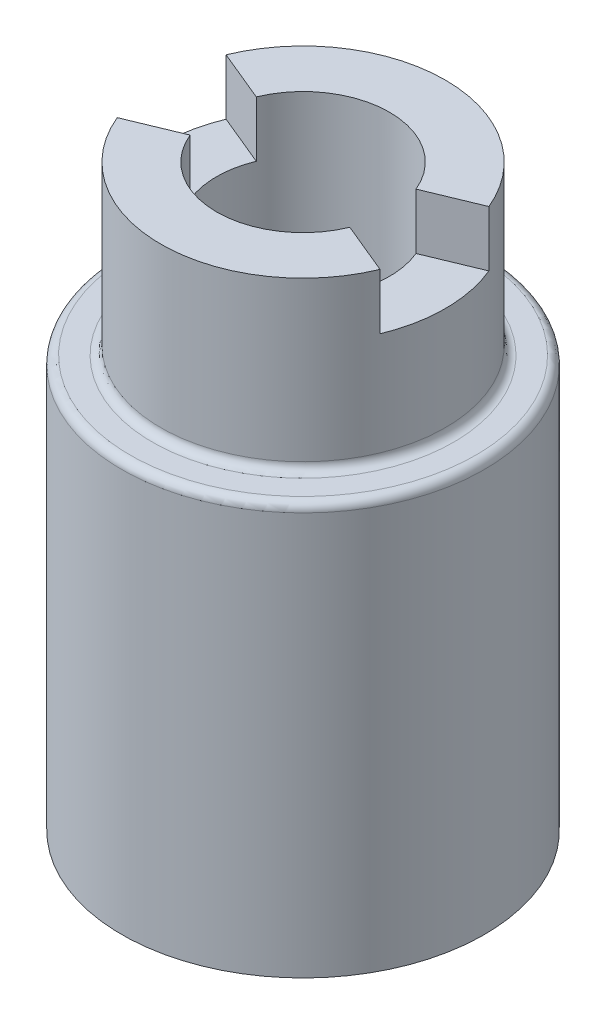
ISO-10303-21;
HEADER;
FILE_DESCRIPTION(('STEP AP214'),'2;1');
FILE_NAME('part.step','',(''),(''),'','','');
FILE_SCHEMA(('AUTOMOTIVE_DESIGN { 1 0 10303 214 1 1 1 1 }'));
ENDSEC;
DATA;
#1=APPLICATION_CONTEXT('core data for automotive mechanical design processes');
#2=APPLICATION_PROTOCOL_DEFINITION('international standard','automotive_design',2000,#1);
#3=PRODUCT_CONTEXT('',#1,'mechanical');
#4=PRODUCT('Part','Part','',(#3));
#5=PRODUCT_RELATED_PRODUCT_CATEGORY('part','',(#4));
#6=PRODUCT_DEFINITION_FORMATION('','',#4);
#7=PRODUCT_DEFINITION_CONTEXT('part definition',#1,'design');
#8=PRODUCT_DEFINITION('design','',#6,#7);
#9=PRODUCT_DEFINITION_SHAPE('','',#8);
#10=(LENGTH_UNIT() NAMED_UNIT(*) SI_UNIT(.MILLI.,.METRE.));
#11=(NAMED_UNIT(*) PLANE_ANGLE_UNIT() SI_UNIT($,.RADIAN.));
#12=(NAMED_UNIT(*) SI_UNIT($,.STERADIAN.) SOLID_ANGLE_UNIT());
#13=UNCERTAINTY_MEASURE_WITH_UNIT(LENGTH_MEASURE(1.E-05),#10,'distance_accuracy_value','');
#14=(GEOMETRIC_REPRESENTATION_CONTEXT(3) GLOBAL_UNCERTAINTY_ASSIGNED_CONTEXT((#13)) GLOBAL_UNIT_ASSIGNED_CONTEXT((#10,
#11,#12)) REPRESENTATION_CONTEXT('',''));
#15=CARTESIAN_POINT('',(0.,0.,0.));
#16=DIRECTION('',(0.,0.,1.));
#17=DIRECTION('',(1.,0.,0.));
#18=AXIS2_PLACEMENT_3D('',#15,#16,#17);
#19=CARTESIAN_POINT('',(0.,0.,0.));
#20=DIRECTION('',(0.,-1.,0.));
#21=DIRECTION('',(0.,0.,-1.));
#22=AXIS2_PLACEMENT_3D('',#19,#20,#21);
#23=CYLINDRICAL_SURFACE('',#22,3.1);
#24=DIRECTION('',(0.,-1.,0.));
#25=VECTOR('',#24,1.);
#26=CARTESIAN_POINT('',(-3.08820356408441,0.,0.270182802517741));
#27=LINE('',#26,#25);
#28=CARTESIAN_POINT('',(-3.08820356408441,25.5205151430413,0.270182802517741));
#29=VERTEX_POINT('',#28);
#30=CARTESIAN_POINT('',(-3.08820356408441,25.188893913169,0.270182802517741));
#31=VERTEX_POINT('',#30);
#32=EDGE_CURVE('E56',#29,#31,#27,.T.);
#33=ORIENTED_EDGE('',*,*,#32,.F.);
#34=CARTESIAN_POINT('',(0.,25.5205151430413,0.));
#35=DIRECTION('',(0.,-1.,0.));
#36=DIRECTION('',(0.,0.,-1.));
#37=AXIS2_PLACEMENT_3D('',#34,#35,#36);
#38=CIRCLE('',#37,3.1);
#39=CARTESIAN_POINT('',(-3.08820356408441,25.5205151430413,-0.270182802517741));
#40=VERTEX_POINT('',#39);
#41=EDGE_CURVE('E356',#29,#40,#38,.T.);
#42=ORIENTED_EDGE('',*,*,#41,.T.);
#43=DIRECTION('',(0.,-1.,0.));
#44=VECTOR('',#43,1.);
#45=CARTESIAN_POINT('',(-3.08820356408441,0.,-0.270182802517741));
#46=LINE('',#45,#44);
#47=CARTESIAN_POINT('',(-3.08820356408441,25.188893913169,-0.270182802517741));
#48=VERTEX_POINT('',#47);
#49=EDGE_CURVE('E63',#40,#48,#46,.T.);
#50=ORIENTED_EDGE('',*,*,#49,.T.);
#51=CARTESIAN_POINT('',(0.,25.188893913169,0.));
#52=DIRECTION('',(0.,1.,0.));
#53=DIRECTION('',(0.,0.,1.));
#54=AXIS2_PLACEMENT_3D('',#51,#52,#53);
#55=CIRCLE('',#54,3.1);
#56=EDGE_CURVE('E271',#48,#31,#55,.F.);
#57=ORIENTED_EDGE('',*,*,#56,.T.);
#58=EDGE_LOOP('',(#33,#42,#50,#57));
#59=FACE_BOUND('',#58,.T.);
#60=DIRECTION('',(0.,-1.,0.));
#61=VECTOR('',#60,1.);
#62=CARTESIAN_POINT('',(2.86402655078499,0.,-1.18631864033178));
#63=LINE('',#62,#61);
#64=CARTESIAN_POINT('',(2.86402655078499,32.2225862550139,-1.18631864033178));
#65=VERTEX_POINT('',#64);
#66=CARTESIAN_POINT('',(2.86402655078499,30.2225862550139,-1.18631864033178));
#67=VERTEX_POINT('',#66);
#68=EDGE_CURVE('E236',#65,#67,#63,.T.);
#69=ORIENTED_EDGE('',*,*,#68,.F.);
#70=CARTESIAN_POINT('',(0.,32.2225862550139,0.));
#71=DIRECTION('',(0.,-1.,0.));
#72=DIRECTION('',(0.,0.,-1.));
#73=AXIS2_PLACEMENT_3D('',#70,#71,#72);
#74=CIRCLE('',#73,3.1);
#75=CARTESIAN_POINT('',(-2.86402655078499,32.2225862550139,-1.18631864033178));
#76=VERTEX_POINT('',#75);
#77=EDGE_CURVE('E251',#76,#65,#74,.T.);
#78=ORIENTED_EDGE('',*,*,#77,.F.);
#79=DIRECTION('',(0.,-1.,0.));
#80=VECTOR('',#79,1.);
#81=CARTESIAN_POINT('',(-2.86402655078499,0.,-1.18631864033178));
#82=LINE('',#81,#80);
#83=CARTESIAN_POINT('',(-2.86402655078499,30.2225862550139,-1.18631864033178));
#84=VERTEX_POINT('',#83);
#85=EDGE_CURVE('E450',#84,#76,#82,.F.);
#86=ORIENTED_EDGE('',*,*,#85,.F.);
#87=CARTESIAN_POINT('',(0.,30.2225862550139,0.));
#88=DIRECTION('',(0.,-1.,0.));
#89=DIRECTION('',(0.,0.,-1.));
#90=AXIS2_PLACEMENT_3D('',#87,#88,#89);
#91=CIRCLE('',#90,3.1);
#92=CARTESIAN_POINT('',(-2.86402655078499,30.2225862550139,1.18631864033178));
#93=VERTEX_POINT('',#92);
#94=EDGE_CURVE('E452',#84,#93,#91,.F.);
#95=ORIENTED_EDGE('',*,*,#94,.T.);
#96=DIRECTION('',(0.,-1.,0.));
#97=VECTOR('',#96,1.);
#98=CARTESIAN_POINT('',(-2.86402655078499,0.,1.18631864033178));
#99=LINE('',#98,#97);
#100=CARTESIAN_POINT('',(-2.86402655078499,32.2225862550139,1.18631864033178));
#101=VERTEX_POINT('',#100);
#102=EDGE_CURVE('E250',#93,#101,#99,.F.);
#103=ORIENTED_EDGE('',*,*,#102,.T.);
#104=CARTESIAN_POINT('',(2.86402655078499,32.2225862550139,1.18631864033178));
#105=VERTEX_POINT('',#104);
#106=EDGE_CURVE('E243',#105,#101,#74,.T.);
#107=ORIENTED_EDGE('',*,*,#106,.F.);
#108=DIRECTION('',(0.,-1.,0.));
#109=VECTOR('',#108,1.);
#110=CARTESIAN_POINT('',(2.86402655078499,0.,1.18631864033178));
#111=LINE('',#110,#109);
#112=CARTESIAN_POINT('',(2.86402655078499,30.2225862550139,1.18631864033178));
#113=VERTEX_POINT('',#112);
#114=EDGE_CURVE('E226',#105,#113,#111,.T.);
#115=ORIENTED_EDGE('',*,*,#114,.T.);
#116=CARTESIAN_POINT('',(0.,30.2225862550139,0.));
#117=DIRECTION('',(0.,-1.,0.));
#118=DIRECTION('',(0.,0.,-1.));
#119=AXIS2_PLACEMENT_3D('',#116,#117,#118);
#120=CIRCLE('',#119,3.1);
#121=EDGE_CURVE('E438',#113,#67,#120,.F.);
#122=ORIENTED_EDGE('',*,*,#121,.T.);
#123=EDGE_LOOP('',(#69,#78,#86,#95,#103,#107,#115,#122));
#124=FACE_BOUND('',#123,.T.);
#125=ADVANCED_FACE('F41',(#59,#124),#23,.F.);
#126=CARTESIAN_POINT('',(-3.1,32.2225862550139,0.));
#127=DIRECTION('',(0.,-1.,0.));
#128=DIRECTION('',(0.,0.,-1.));
#129=AXIS2_PLACEMENT_3D('',#126,#127,#128);
#130=PLANE('',#129);
#131=DIRECTION('',(0.923879532511287,0.,-0.382683432365091));
#132=VECTOR('',#131,1.);
#133=CARTESIAN_POINT('',(0.,32.2225862550139,0.));
#134=LINE('',#133,#132);
#135=CARTESIAN_POINT('',(4.71178561580757,32.2225862550139,-1.95168550506197));
#136=VERTEX_POINT('',#135);
#137=EDGE_CURVE('E853',#65,#136,#134,.T.);
#138=ORIENTED_EDGE('',*,*,#137,.T.);
#139=CARTESIAN_POINT('',(0.,32.2225862550139,0.));
#140=DIRECTION('',(0.,-1.,0.));
#141=DIRECTION('',(0.,0.,-1.));
#142=AXIS2_PLACEMENT_3D('',#139,#140,#141);
#143=CIRCLE('',#142,5.1);
#144=CARTESIAN_POINT('',(-4.71178561580757,32.2225862550139,-1.95168550506197));
#145=VERTEX_POINT('',#144);
#146=EDGE_CURVE('E252',#145,#136,#143,.T.);
#147=ORIENTED_EDGE('',*,*,#146,.F.);
#148=DIRECTION('',(-0.923879532511287,0.,-0.382683432365091));
#149=VECTOR('',#148,1.);
#150=CARTESIAN_POINT('',(0.,32.2225862550139,0.));
#151=LINE('',#150,#149);
#152=EDGE_CURVE('E440',#76,#145,#151,.T.);
#153=ORIENTED_EDGE('',*,*,#152,.F.);
#154=ORIENTED_EDGE('',*,*,#77,.T.);
#155=EDGE_LOOP('',(#138,#147,#153,#154));
#156=FACE_BOUND('',#155,.T.);
#157=ADVANCED_FACE('F505',(#156),#130,.F.);
#158=CARTESIAN_POINT('',(0.,0.,0.));
#159=DIRECTION('',(0.,-1.,0.));
#160=DIRECTION('',(0.,0.,-1.));
#161=AXIS2_PLACEMENT_3D('',#158,#159,#160);
#162=CYLINDRICAL_SURFACE('',#161,5.1);
#163=CARTESIAN_POINT('',(0.,26.522586255014,0.));
#164=DIRECTION('',(0.,-1.,0.));
#165=DIRECTION('',(0.,0.,-1.));
#166=AXIS2_PLACEMENT_3D('',#163,#164,#165);
#167=CIRCLE('',#166,5.1);
#168=CARTESIAN_POINT('',(0.,26.522586255014,-5.1));
#169=VERTEX_POINT('',#168);
#170=EDGE_CURVE('E268',#169,#169,#167,.F.);
#171=ORIENTED_EDGE('',*,*,#170,.T.);
#172=EDGE_LOOP('',(#171));
#173=FACE_BOUND('',#172,.T.);
#174=DIRECTION('',(0.,-1.,0.));
#175=VECTOR('',#174,1.);
#176=CARTESIAN_POINT('',(4.71178561580756,0.,-1.95168550506196));
#177=LINE('',#176,#175);
#178=CARTESIAN_POINT('',(4.71178561580756,30.2225862550139,-1.95168550506196));
#179=VERTEX_POINT('',#178);
#180=EDGE_CURVE('E292',#179,#136,#177,.F.);
#181=ORIENTED_EDGE('',*,*,#180,.F.);
#182=CARTESIAN_POINT('',(0.,30.2225862550139,0.));
#183=DIRECTION('',(0.,-1.,0.));
#184=DIRECTION('',(0.,0.,-1.));
#185=AXIS2_PLACEMENT_3D('',#182,#183,#184);
#186=CIRCLE('',#185,5.1);
#187=CARTESIAN_POINT('',(4.71178561580756,30.2225862550139,1.95168550506196));
#188=VERTEX_POINT('',#187);
#189=EDGE_CURVE('E289',#179,#188,#186,.T.);
#190=ORIENTED_EDGE('',*,*,#189,.T.);
#191=DIRECTION('',(0.,-1.,0.));
#192=VECTOR('',#191,1.);
#193=CARTESIAN_POINT('',(4.71178561580756,0.,1.95168550506196));
#194=LINE('',#193,#192);
#195=CARTESIAN_POINT('',(4.71178561580756,32.2225862550139,1.95168550506196));
#196=VERTEX_POINT('',#195);
#197=EDGE_CURVE('E287',#188,#196,#194,.F.);
#198=ORIENTED_EDGE('',*,*,#197,.T.);
#199=CARTESIAN_POINT('',(-4.71178561580757,32.2225862550139,1.95168550506196));
#200=VERTEX_POINT('',#199);
#201=EDGE_CURVE('E245',#196,#200,#143,.T.);
#202=ORIENTED_EDGE('',*,*,#201,.T.);
#203=DIRECTION('',(0.,-1.,0.));
#204=VECTOR('',#203,1.);
#205=CARTESIAN_POINT('',(-4.71178561580756,0.,1.95168550506196));
#206=LINE('',#205,#204);
#207=CARTESIAN_POINT('',(-4.71178561580756,30.2225862550139,1.95168550506196));
#208=VERTEX_POINT('',#207);
#209=EDGE_CURVE('E279',#200,#208,#206,.T.);
#210=ORIENTED_EDGE('',*,*,#209,.T.);
#211=CARTESIAN_POINT('',(0.,30.2225862550139,0.));
#212=DIRECTION('',(0.,-1.,0.));
#213=DIRECTION('',(0.,0.,-1.));
#214=AXIS2_PLACEMENT_3D('',#211,#212,#213);
#215=CIRCLE('',#214,5.1);
#216=CARTESIAN_POINT('',(-4.71178561580756,30.2225862550139,-1.95168550506196));
#217=VERTEX_POINT('',#216);
#218=EDGE_CURVE('E282',#208,#217,#215,.T.);
#219=ORIENTED_EDGE('',*,*,#218,.T.);
#220=DIRECTION('',(0.,-1.,0.));
#221=VECTOR('',#220,1.);
#222=CARTESIAN_POINT('',(-4.71178561580756,0.,-1.95168550506196));
#223=LINE('',#222,#221);
#224=EDGE_CURVE('E285',#145,#217,#223,.T.);
#225=ORIENTED_EDGE('',*,*,#224,.F.);
#226=ORIENTED_EDGE('',*,*,#146,.T.);
#227=EDGE_LOOP('',(#181,#190,#198,#202,#210,#219,#225,#226));
#228=FACE_BOUND('',#227,.T.);
#229=ADVANCED_FACE('F431',(#173,#228),#162,.T.);
#230=ORIENTED_EDGE('',*,*,#201,.F.);
#231=DIRECTION('',(0.923879532511287,0.,0.382683432365091));
#232=VECTOR('',#231,1.);
#233=CARTESIAN_POINT('',(0.,32.2225862550139,0.));
#234=LINE('',#233,#232);
#235=EDGE_CURVE('E229',#105,#196,#234,.T.);
#236=ORIENTED_EDGE('',*,*,#235,.F.);
#237=ORIENTED_EDGE('',*,*,#106,.T.);
#238=DIRECTION('',(-0.923879532511287,0.,0.382683432365091));
#239=VECTOR('',#238,1.);
#240=CARTESIAN_POINT('',(0.,32.2225862550139,0.));
#241=LINE('',#240,#239);
#242=EDGE_CURVE('E434',#101,#200,#241,.T.);
#243=ORIENTED_EDGE('',*,*,#242,.T.);
#244=EDGE_LOOP('',(#230,#236,#237,#243));
#245=FACE_BOUND('',#244,.T.);
#246=ADVANCED_FACE('F241',(#245),#130,.F.);
#247=CARTESIAN_POINT('',(0.,0.,0.));
#248=DIRECTION('',(0.,-1.,0.));
#249=DIRECTION('',(0.,0.,-1.));
#250=AXIS2_PLACEMENT_3D('',#247,#248,#249);
#251=CYLINDRICAL_SURFACE('',#250,5.45);
#252=DIRECTION('',(0.,-1.,0.));
#253=VECTOR('',#252,1.);
#254=CARTESIAN_POINT('',(-5.42926110460001,0.,0.474998797974738));
#255=LINE('',#254,#253);
#256=CARTESIAN_POINT('',(-5.42926110460001,22.6108098243009,0.474998797974738));
#257=VERTEX_POINT('',#256);
#258=CARTESIAN_POINT('',(-5.42926110460001,18.7040713559319,0.474998797974738));
#259=VERTEX_POINT('',#258);
#260=EDGE_CURVE('E386',#257,#259,#255,.T.);
#261=ORIENTED_EDGE('',*,*,#260,.F.);
#262=CARTESIAN_POINT('',(0.,22.6108098243009,0.));
#263=DIRECTION('',(0.,-1.,0.));
#264=DIRECTION('',(0.,0.,-1.));
#265=AXIS2_PLACEMENT_3D('',#262,#263,#264);
#266=CIRCLE('',#265,5.45);
#267=CARTESIAN_POINT('',(-5.42926110460001,22.6108098243009,-0.474998797974738));
#268=VERTEX_POINT('',#267);
#269=EDGE_CURVE('E311',#257,#268,#266,.F.);
#270=ORIENTED_EDGE('',*,*,#269,.T.);
#271=DIRECTION('',(0.,-1.,0.));
#272=VECTOR('',#271,1.);
#273=CARTESIAN_POINT('',(-5.42926110460001,0.,-0.474998797974738));
#274=LINE('',#273,#272);
#275=CARTESIAN_POINT('',(-5.42926110460001,18.7040713559319,-0.474998797974738));
#276=VERTEX_POINT('',#275);
#277=EDGE_CURVE('E414',#268,#276,#274,.T.);
#278=ORIENTED_EDGE('',*,*,#277,.T.);
#279=CARTESIAN_POINT('',(0.,18.7040713559319,0.));
#280=DIRECTION('',(0.,-1.,0.));
#281=DIRECTION('',(0.,0.,-1.));
#282=AXIS2_PLACEMENT_3D('',#279,#280,#281);
#283=CIRCLE('',#282,5.45);
#284=EDGE_CURVE('E308',#276,#259,#283,.T.);
#285=ORIENTED_EDGE('',*,*,#284,.T.);
#286=EDGE_LOOP('',(#261,#270,#278,#285));
#287=FACE_BOUND('',#286,.T.);
#288=ADVANCED_FACE('F488',(#287),#251,.F.);
#289=CARTESIAN_POINT('',(0.,22.7507021217474,0.));
#290=DIRECTION('',(0.,-1.,0.));
#291=DIRECTION('',(0.,0.,-1.));
#292=AXIS2_PLACEMENT_3D('',#289,#290,#291);
#293=CONICAL_SURFACE('',#292,5.45,0.872664625997166);
#294=DIRECTION('',(-0.763129412737771,-0.642787609686538,-0.0667651724177509));
#295=VECTOR('',#294,1.);
#296=CARTESIAN_POINT('',(-13.4031447981428,16.0342611698743,-1.17262322543395));
#297=LINE('',#296,#295);
#298=CARTESIAN_POINT('',(-3.44405665340736,24.42284947005,-0.301315913714177));
#299=VERTEX_POINT('',#298);
#300=CARTESIAN_POINT('',(-5.32250517780312,22.8406231572365,-0.465658864615807));
#301=VERTEX_POINT('',#300);
#302=EDGE_CURVE('E417',#299,#301,#297,.T.);
#303=ORIENTED_EDGE('',*,*,#302,.T.);
#304=CARTESIAN_POINT('',(0.,22.8406231572365,0.));
#305=DIRECTION('',(0.,-1.,0.));
#306=DIRECTION('',(0.,0.,-1.));
#307=AXIS2_PLACEMENT_3D('',#304,#305,#306);
#308=CIRCLE('',#307,5.34283628290596);
#309=CARTESIAN_POINT('',(-5.32250517780312,22.8406231572365,0.465658864615807));
#310=VERTEX_POINT('',#309);
#311=EDGE_CURVE('E305',#301,#310,#308,.T.);
#312=ORIENTED_EDGE('',*,*,#311,.T.);
#313=DIRECTION('',(-0.763129412737771,-0.642787609686538,0.0667651724177509));
#314=VECTOR('',#313,1.);
#315=CARTESIAN_POINT('',(-13.4031447981428,16.0342611698743,1.17262322543395));
#316=LINE('',#315,#314);
#317=CARTESIAN_POINT('',(-3.44405665340736,24.42284947005,0.301315913714177));
#318=VERTEX_POINT('',#317);
#319=EDGE_CURVE('E373',#318,#310,#316,.T.);
#320=ORIENTED_EDGE('',*,*,#319,.F.);
#321=CARTESIAN_POINT('',(0.,24.42284947005,0.));
#322=DIRECTION('',(0.,1.,0.));
#323=DIRECTION('',(0.,0.,1.));
#324=AXIS2_PLACEMENT_3D('',#321,#322,#323);
#325=CIRCLE('',#324,3.45721239031347);
#326=EDGE_CURVE('E275',#318,#299,#325,.T.);
#327=ORIENTED_EDGE('',*,*,#326,.T.);
#328=EDGE_LOOP('',(#303,#312,#320,#327));
#329=FACE_BOUND('',#328,.T.);
#330=ADVANCED_FACE('F383',(#329),#293,.F.);
#331=CARTESIAN_POINT('',(-6.5,11.4817405342667,0.));
#332=DIRECTION('',(0.,1.,0.));
#333=DIRECTION('',(0.,0.,1.));
#334=AXIS2_PLACEMENT_3D('',#331,#332,#333);
#335=PLANE('',#334);
#336=CARTESIAN_POINT('',(0.,11.4817405342667,0.));
#337=DIRECTION('',(0.,-1.,0.));
#338=DIRECTION('',(0.,0.,-1.));
#339=AXIS2_PLACEMENT_3D('',#336,#337,#338);
#340=CIRCLE('',#339,6.5);
#341=CARTESIAN_POINT('',(0.,11.4817405342667,-6.5));
#342=VERTEX_POINT('',#341);
#343=EDGE_CURVE('E424',#342,#342,#340,.T.);
#344=ORIENTED_EDGE('',*,*,#343,.T.);
#345=EDGE_LOOP('',(#344));
#346=FACE_BOUND('',#345,.T.);
#347=DIRECTION('',(0.996194698091746,0.,0.0871557427476583));
#348=VECTOR('',#347,1.);
#349=CARTESIAN_POINT('',(0.,11.4817405342667,0.));
#350=LINE('',#349,#348);
#351=CARTESIAN_POINT('',(-4.7916964978213,11.4817405342667,-0.419219122616237));
#352=VERTEX_POINT('',#351);
#353=CARTESIAN_POINT('',(-4.14416994406166,11.4817405342667,-0.362567889830259));
#354=VERTEX_POINT('',#353);
#355=EDGE_CURVE('E406',#352,#354,#350,.T.);
#356=ORIENTED_EDGE('',*,*,#355,.F.);
#357=CARTESIAN_POINT('',(0.,11.4817405342667,0.));
#358=DIRECTION('',(0.,1.,0.));
#359=DIRECTION('',(0.,0.,1.));
#360=AXIS2_PLACEMENT_3D('',#357,#358,#359);
#361=CIRCLE('',#360,4.81);
#362=CARTESIAN_POINT('',(-4.7916964978213,11.4817405342667,0.419219122616237));
#363=VERTEX_POINT('',#362);
#364=EDGE_CURVE('E419',#352,#363,#361,.T.);
#365=ORIENTED_EDGE('',*,*,#364,.T.);
#366=DIRECTION('',(0.996194698091746,0.,-0.0871557427476584));
#367=VECTOR('',#366,1.);
#368=CARTESIAN_POINT('',(0.,11.4817405342667,0.));
#369=LINE('',#368,#367);
#370=CARTESIAN_POINT('',(-4.14416994406166,11.4817405342667,0.362567889830259));
#371=VERTEX_POINT('',#370);
#372=EDGE_CURVE('E467',#363,#371,#369,.T.);
#373=ORIENTED_EDGE('',*,*,#372,.T.);
#374=CARTESIAN_POINT('',(0.,11.4817405342667,0.));
#375=DIRECTION('',(0.,-1.,0.));
#376=DIRECTION('',(0.,0.,-1.));
#377=AXIS2_PLACEMENT_3D('',#374,#375,#376);
#378=CIRCLE('',#377,4.16);
#379=EDGE_CURVE('E422',#354,#371,#378,.T.);
#380=ORIENTED_EDGE('',*,*,#379,.F.);
#381=EDGE_LOOP('',(#356,#365,#373,#380));
#382=FACE_BOUND('',#381,.T.);
#383=ADVANCED_FACE('F517',(#346,#382),#335,.F.);
#384=CARTESIAN_POINT('',(0.,0.,0.));
#385=DIRECTION('',(0.,-1.,0.));
#386=DIRECTION('',(0.,0.,-1.));
#387=AXIS2_PLACEMENT_3D('',#384,#385,#386);
#388=CYLINDRICAL_SURFACE('',#387,4.16);
#389=DIRECTION('',(0.,-1.,0.));
#390=VECTOR('',#389,1.);
#391=CARTESIAN_POINT('',(-4.14416994406166,0.,0.362567889830259));
#392=LINE('',#391,#390);
#393=CARTESIAN_POINT('',(-4.14416994406166,17.3418482368202,0.362567889830259));
#394=VERTEX_POINT('',#393);
#395=EDGE_CURVE('E470',#394,#371,#392,.T.);
#396=ORIENTED_EDGE('',*,*,#395,.F.);
#397=CARTESIAN_POINT('',(0.,17.3418482368202,0.));
#398=DIRECTION('',(0.,1.,0.));
#399=DIRECTION('',(0.,0.,1.));
#400=AXIS2_PLACEMENT_3D('',#397,#398,#399);
#401=CIRCLE('',#400,4.16);
#402=CARTESIAN_POINT('',(-4.14416994406166,17.3418482368202,-0.362567889830259));
#403=VERTEX_POINT('',#402);
#404=EDGE_CURVE('E301',#394,#403,#401,.T.);
#405=ORIENTED_EDGE('',*,*,#404,.T.);
#406=DIRECTION('',(0.,-1.,0.));
#407=VECTOR('',#406,1.);
#408=CARTESIAN_POINT('',(-4.14416994406166,0.,-0.362567889830259));
#409=LINE('',#408,#407);
#410=EDGE_CURVE('E409',#403,#354,#409,.T.);
#411=ORIENTED_EDGE('',*,*,#410,.T.);
#412=ORIENTED_EDGE('',*,*,#379,.T.);
#413=EDGE_LOOP('',(#396,#405,#411,#412));
#414=FACE_BOUND('',#413,.T.);
#415=ADVANCED_FACE('F574',(#414),#388,.F.);
#416=CARTESIAN_POINT('',(0.,17.4817405342667,0.));
#417=DIRECTION('',(0.,1.,0.));
#418=DIRECTION('',(0.,0.,1.));
#419=AXIS2_PLACEMENT_3D('',#416,#417,#418);
#420=CONICAL_SURFACE('',#419,4.16,0.872664625997168);
#421=DIRECTION('',(0.763129412737771,-0.642787609686537,0.066765172417751));
#422=VECTOR('',#421,1.);
#423=CARTESIAN_POINT('',(6.86304928337952,8.21030633397875,0.600439009515426));
#424=LINE('',#423,#422);
#425=CARTESIAN_POINT('',(-5.32250517780313,18.4742580229962,-0.465658864615807));
#426=VERTEX_POINT('',#425);
#427=CARTESIAN_POINT('',(-4.25092587085855,17.5716615697559,-0.37190782318919));
#428=VERTEX_POINT('',#427);
#429=EDGE_CURVE('E411',#426,#428,#424,.T.);
#430=ORIENTED_EDGE('',*,*,#429,.T.);
#431=CARTESIAN_POINT('',(0.,17.5716615697559,0.));
#432=DIRECTION('',(0.,-1.,0.));
#433=DIRECTION('',(0.,0.,-1.));
#434=AXIS2_PLACEMENT_3D('',#431,#432,#433);
#435=CIRCLE('',#434,4.26716371709404);
#436=CARTESIAN_POINT('',(-4.25092587085855,17.5716615697559,0.37190782318919));
#437=VERTEX_POINT('',#436);
#438=EDGE_CURVE('E296',#428,#437,#435,.T.);
#439=ORIENTED_EDGE('',*,*,#438,.T.);
#440=DIRECTION('',(0.763129412737771,-0.642787609686537,-0.066765172417751));
#441=VECTOR('',#440,1.);
#442=CARTESIAN_POINT('',(6.86304928337952,8.21030633397875,-0.600439009515426));
#443=LINE('',#442,#441);
#444=CARTESIAN_POINT('',(-5.32250517780312,18.4742580229962,0.465658864615806));
#445=VERTEX_POINT('',#444);
#446=EDGE_CURVE('E389',#445,#437,#443,.T.);
#447=ORIENTED_EDGE('',*,*,#446,.F.);
#448=CARTESIAN_POINT('',(0.,18.4742580229962,0.));
#449=DIRECTION('',(0.,1.,0.));
#450=DIRECTION('',(0.,0.,1.));
#451=AXIS2_PLACEMENT_3D('',#448,#449,#450);
#452=CIRCLE('',#451,5.34283628290596);
#453=EDGE_CURVE('E294',#445,#426,#452,.T.);
#454=ORIENTED_EDGE('',*,*,#453,.T.);
#455=EDGE_LOOP('',(#430,#439,#447,#454));
#456=FACE_BOUND('',#455,.T.);
#457=ADVANCED_FACE('F476',(#456),#420,.F.);
#458=CARTESIAN_POINT('',(-5.1,26.222586255014,0.));
#459=DIRECTION('',(0.,-1.,0.));
#460=DIRECTION('',(0.,0.,-1.));
#461=AXIS2_PLACEMENT_3D('',#458,#459,#460);
#462=PLANE('',#461);
#463=CARTESIAN_POINT('',(0.,26.222586255014,0.));
#464=DIRECTION('',(0.,-1.,0.));
#465=DIRECTION('',(0.,0.,-1.));
#466=AXIS2_PLACEMENT_3D('',#463,#464,#465);
#467=CIRCLE('',#466,6.2);
#468=CARTESIAN_POINT('',(0.,26.222586255014,-6.2));
#469=VERTEX_POINT('',#468);
#470=EDGE_CURVE('E265',#469,#469,#467,.F.);
#471=ORIENTED_EDGE('',*,*,#470,.T.);
#472=EDGE_LOOP('',(#471));
#473=FACE_BOUND('',#472,.T.);
#474=CARTESIAN_POINT('',(0.,26.222586255014,0.));
#475=DIRECTION('',(0.,-1.,0.));
#476=DIRECTION('',(0.,0.,-1.));
#477=AXIS2_PLACEMENT_3D('',#474,#475,#476);
#478=CIRCLE('',#477,5.4);
#479=CARTESIAN_POINT('',(0.,26.222586255014,-5.4));
#480=VERTEX_POINT('',#479);
#481=EDGE_CURVE('E262',#480,#480,#478,.T.);
#482=ORIENTED_EDGE('',*,*,#481,.T.);
#483=EDGE_LOOP('',(#482));
#484=FACE_BOUND('',#483,.T.);
#485=ADVANCED_FACE('F573',(#473,#484),#462,.F.);
#486=CARTESIAN_POINT('',(0.,0.,0.));
#487=DIRECTION('',(0.,-1.,0.));
#488=DIRECTION('',(0.,0.,-1.));
#489=AXIS2_PLACEMENT_3D('',#486,#487,#488);
#490=CYLINDRICAL_SURFACE('',#489,6.5);
#491=CARTESIAN_POINT('',(0.,25.922586255014,0.));
#492=DIRECTION('',(0.,-1.,0.));
#493=DIRECTION('',(0.,0.,-1.));
#494=AXIS2_PLACEMENT_3D('',#491,#492,#493);
#495=CIRCLE('',#494,6.5);
#496=CARTESIAN_POINT('',(0.,25.922586255014,-6.5));
#497=VERTEX_POINT('',#496);
#498=EDGE_CURVE('E255',#497,#497,#495,.T.);
#499=ORIENTED_EDGE('',*,*,#498,.T.);
#500=EDGE_LOOP('',(#499));
#501=FACE_BOUND('',#500,.T.);
#502=ORIENTED_EDGE('',*,*,#343,.F.);
#503=EDGE_LOOP('',(#502));
#504=FACE_BOUND('',#503,.T.);
#505=ADVANCED_FACE('F569',(#501,#504),#490,.T.);
#506=CARTESIAN_POINT('',(0.,25.2205151430413,0.));
#507=DIRECTION('',(0.,-1.,0.));
#508=DIRECTION('',(0.,0.,-1.));
#509=AXIS2_PLACEMENT_3D('',#506,#507,#508);
#510=PLANE('',#509);
#511=DIRECTION('',(0.996194698091746,0.,-0.0871557427476584));
#512=VECTOR('',#511,1.);
#513=CARTESIAN_POINT('',(0.,25.2205151430413,0.));
#514=LINE('',#513,#512);
#515=CARTESIAN_POINT('',(-3.39565004449237,25.2205151430413,0.297080884194382));
#516=VERTEX_POINT('',#515);
#517=CARTESIAN_POINT('',(-3.38706197351194,25.2205151430413,0.296329525342039));
#518=VERTEX_POINT('',#517);
#519=EDGE_CURVE('E367',#516,#518,#514,.T.);
#520=ORIENTED_EDGE('',*,*,#519,.F.);
#521=CARTESIAN_POINT('',(0.,25.2205151430413,0.));
#522=DIRECTION('',(0.,-1.,0.));
#523=DIRECTION('',(0.,0.,-1.));
#524=AXIS2_PLACEMENT_3D('',#521,#522,#523);
#525=CIRCLE('',#524,3.40862087601639);
#526=CARTESIAN_POINT('',(-3.39565004449237,25.2205151430413,-0.297080884194382));
#527=VERTEX_POINT('',#526);
#528=EDGE_CURVE('E354',#516,#527,#525,.T.);
#529=ORIENTED_EDGE('',*,*,#528,.T.);
#530=DIRECTION('',(0.996194698091746,0.,0.0871557427476583));
#531=VECTOR('',#530,1.);
#532=CARTESIAN_POINT('',(0.,25.2205151430413,0.));
#533=LINE('',#532,#531);
#534=CARTESIAN_POINT('',(-3.38706197351194,25.2205151430413,-0.296329525342039));
#535=VERTEX_POINT('',#534);
#536=EDGE_CURVE('E372',#527,#535,#533,.T.);
#537=ORIENTED_EDGE('',*,*,#536,.T.);
#538=CARTESIAN_POINT('',(0.,25.2205151430413,0.));
#539=DIRECTION('',(0.,-1.,0.));
#540=DIRECTION('',(0.,0.,-1.));
#541=AXIS2_PLACEMENT_3D('',#538,#539,#540);
#542=CIRCLE('',#541,3.4);
#543=EDGE_CURVE('E351',#535,#518,#542,.F.);
#544=ORIENTED_EDGE('',*,*,#543,.T.);
#545=EDGE_LOOP('',(#520,#529,#537,#544));
#546=FACE_BOUND('',#545,.T.);
#547=ADVANCED_FACE('F565',(#546),#510,.T.);
#548=CARTESIAN_POINT('',(0.,25.2205151430413,0.));
#549=DIRECTION('',(0.,-1.,0.));
#550=DIRECTION('',(0.,0.,-1.));
#551=AXIS2_PLACEMENT_3D('',#548,#549,#550);
#552=CONICAL_SURFACE('',#551,3.51781194629625,0.872664625997166);
#553=DIRECTION('',(-0.763129412737771,-0.642787609686538,0.0667651724177509));
#554=VECTOR('',#553,1.);
#555=CARTESIAN_POINT('',(-13.8193668438425,16.5321900579016,1.20903793594225));
#556=LINE('',#555,#554);
#557=CARTESIAN_POINT('',(-3.58775252712301,25.150328475977,0.313887673659749));
#558=VERTEX_POINT('',#557);
#559=CARTESIAN_POINT('',(-5.97003173156276,23.1437231350373,0.522310097401785));
#560=VERTEX_POINT('',#559);
#561=EDGE_CURVE('E456',#558,#560,#556,.T.);
#562=ORIENTED_EDGE('',*,*,#561,.T.);
#563=CARTESIAN_POINT('',(0.,23.1437231350373,0.));
#564=DIRECTION('',(0.,-1.,0.));
#565=DIRECTION('',(0.,0.,-1.));
#566=AXIS2_PLACEMENT_3D('',#563,#564,#565);
#567=CIRCLE('',#566,5.99283628290596);
#568=CARTESIAN_POINT('',(-5.97003173156276,23.1437231350373,-0.522310097401785));
#569=VERTEX_POINT('',#568);
#570=EDGE_CURVE('E349',#560,#569,#567,.T.);
#571=ORIENTED_EDGE('',*,*,#570,.T.);
#572=DIRECTION('',(-0.763129412737771,-0.642787609686538,-0.0667651724177509));
#573=VECTOR('',#572,1.);
#574=CARTESIAN_POINT('',(-13.8193668438425,16.5321900579016,-1.20903793594225));
#575=LINE('',#574,#573);
#576=CARTESIAN_POINT('',(-3.587752527123,25.150328475977,-0.313887673659749));
#577=VERTEX_POINT('',#576);
#578=EDGE_CURVE('E395',#577,#569,#575,.T.);
#579=ORIENTED_EDGE('',*,*,#578,.F.);
#580=CARTESIAN_POINT('',(0.,25.150328475977,0.));
#581=DIRECTION('',(0.,1.,0.));
#582=DIRECTION('',(0.,0.,1.));
#583=AXIS2_PLACEMENT_3D('',#580,#581,#582);
#584=CIRCLE('',#583,3.60145715892235);
#585=EDGE_CURVE('E346',#577,#558,#584,.T.);
#586=ORIENTED_EDGE('',*,*,#585,.T.);
#587=EDGE_LOOP('',(#562,#571,#579,#586));
#588=FACE_BOUND('',#587,.T.);
#589=ADVANCED_FACE('F561',(#588),#552,.F.);
#590=CARTESIAN_POINT('',(0.,0.,0.));
#591=DIRECTION('',(0.,1.,0.));
#592=DIRECTION('',(0.,0.,1.));
#593=AXIS2_PLACEMENT_3D('',#590,#591,#592);
#594=CYLINDRICAL_SURFACE('',#593,6.1);
#595=DIRECTION('',(0.,-1.,0.));
#596=VECTOR('',#595,1.);
#597=CARTESIAN_POINT('',(-6.07678765835964,0.,0.531650030760715));
#598=LINE('',#597,#596);
#599=CARTESIAN_POINT('',(-6.07678765835965,22.9139098021016,0.531650030760716));
#600=VERTEX_POINT('',#599);
#601=CARTESIAN_POINT('',(-6.07678765835964,18.4009713781311,0.531650030760716));
#602=VERTEX_POINT('',#601);
#603=EDGE_CURVE('E459',#600,#602,#598,.T.);
#604=ORIENTED_EDGE('',*,*,#603,.T.);
#605=CARTESIAN_POINT('',(0.,18.4009713781311,0.));
#606=DIRECTION('',(0.,1.,0.));
#607=DIRECTION('',(0.,0.,1.));
#608=AXIS2_PLACEMENT_3D('',#605,#606,#607);
#609=CIRCLE('',#608,6.1);
#610=CARTESIAN_POINT('',(-6.07678765835964,18.4009713781311,-0.531650030760716));
#611=VERTEX_POINT('',#610);
#612=EDGE_CURVE('E335',#602,#611,#609,.F.);
#613=ORIENTED_EDGE('',*,*,#612,.T.);
#614=DIRECTION('',(0.,-1.,0.));
#615=VECTOR('',#614,1.);
#616=CARTESIAN_POINT('',(-6.07678765835964,0.,-0.531650030760715));
#617=LINE('',#616,#615);
#618=CARTESIAN_POINT('',(-6.07678765835965,22.9139098021016,-0.531650030760716));
#619=VERTEX_POINT('',#618);
#620=EDGE_CURVE('E398',#619,#611,#617,.T.);
#621=ORIENTED_EDGE('',*,*,#620,.F.);
#622=CARTESIAN_POINT('',(0.,22.9139098021016,0.));
#623=DIRECTION('',(0.,1.,0.));
#624=DIRECTION('',(0.,0.,1.));
#625=AXIS2_PLACEMENT_3D('',#622,#623,#624);
#626=CIRCLE('',#625,6.1);
#627=EDGE_CURVE('E332',#619,#600,#626,.T.);
#628=ORIENTED_EDGE('',*,*,#627,.T.);
#629=EDGE_LOOP('',(#604,#613,#621,#628));
#630=FACE_BOUND('',#629,.T.);
#631=ADVANCED_FACE('F557',(#630),#594,.F.);
#632=CARTESIAN_POINT('',(0.,18.2610790806846,0.));
#633=DIRECTION('',(0.,1.,0.));
#634=DIRECTION('',(0.,0.,1.));
#635=AXIS2_PLACEMENT_3D('',#632,#633,#634);
#636=CONICAL_SURFACE('',#635,6.1,0.872664625997167);
#637=DIRECTION('',(0.763129412737771,-0.642787609686538,0.066765172417751));
#638=VECTOR('',#637,1.);
#639=CARTESIAN_POINT('',(6.4468272376798,7.71237744595141,0.564024299007132));
#640=LINE('',#639,#638);
#641=CARTESIAN_POINT('',(-5.97003173156277,18.1711580451954,-0.522310097401785));
#642=VERTEX_POINT('',#641);
#643=CARTESIAN_POINT('',(-4.89845242461819,17.2685615919551,-0.428559055975168));
#644=VERTEX_POINT('',#643);
#645=EDGE_CURVE('E401',#642,#644,#640,.T.);
#646=ORIENTED_EDGE('',*,*,#645,.F.);
#647=CARTESIAN_POINT('',(0.,18.1711580451954,0.));
#648=DIRECTION('',(0.,1.,0.));
#649=DIRECTION('',(0.,0.,1.));
#650=AXIS2_PLACEMENT_3D('',#647,#648,#649);
#651=CIRCLE('',#650,5.99283628290596);
#652=CARTESIAN_POINT('',(-5.97003173156276,18.1711580451954,0.522310097401785));
#653=VERTEX_POINT('',#652);
#654=EDGE_CURVE('E323',#642,#653,#651,.T.);
#655=ORIENTED_EDGE('',*,*,#654,.T.);
#656=DIRECTION('',(0.763129412737771,-0.642787609686538,-0.066765172417751));
#657=VECTOR('',#656,1.);
#658=CARTESIAN_POINT('',(6.4468272376798,7.71237744595141,-0.564024299007132));
#659=LINE('',#658,#657);
#660=CARTESIAN_POINT('',(-4.89845242461819,17.2685615919551,0.428559055975168));
#661=VERTEX_POINT('',#660);
#662=EDGE_CURVE('E462',#653,#661,#659,.T.);
#663=ORIENTED_EDGE('',*,*,#662,.T.);
#664=CARTESIAN_POINT('',(0.,17.2685615919551,0.));
#665=DIRECTION('',(0.,-1.,0.));
#666=DIRECTION('',(0.,0.,-1.));
#667=AXIS2_PLACEMENT_3D('',#664,#665,#666);
#668=CIRCLE('',#667,4.91716371709404);
#669=EDGE_CURVE('E321',#661,#644,#668,.T.);
#670=ORIENTED_EDGE('',*,*,#669,.T.);
#671=EDGE_LOOP('',(#646,#655,#663,#670));
#672=FACE_BOUND('',#671,.T.);
#673=ADVANCED_FACE('F553',(#672),#636,.F.);
#674=CARTESIAN_POINT('',(0.,0.,0.));
#675=DIRECTION('',(0.,1.,0.));
#676=DIRECTION('',(0.,0.,1.));
#677=AXIS2_PLACEMENT_3D('',#674,#675,#676);
#678=CYLINDRICAL_SURFACE('',#677,4.81);
#679=DIRECTION('',(0.,-1.,0.));
#680=VECTOR('',#679,1.);
#681=CARTESIAN_POINT('',(-4.7916964978213,0.,-0.419219122616237));
#682=LINE('',#681,#680);
#683=CARTESIAN_POINT('',(-4.7916964978213,17.0387482590194,-0.419219122616237));
#684=VERTEX_POINT('',#683);
#685=EDGE_CURVE('E404',#684,#352,#682,.T.);
#686=ORIENTED_EDGE('',*,*,#685,.F.);
#687=CARTESIAN_POINT('',(0.,17.0387482590194,0.));
#688=DIRECTION('',(0.,-1.,0.));
#689=DIRECTION('',(0.,0.,-1.));
#690=AXIS2_PLACEMENT_3D('',#687,#688,#689);
#691=CIRCLE('',#690,4.81);
#692=CARTESIAN_POINT('',(-4.7916964978213,17.0387482590194,0.419219122616237));
#693=VERTEX_POINT('',#692);
#694=EDGE_CURVE('E343',#684,#693,#691,.F.);
#695=ORIENTED_EDGE('',*,*,#694,.T.);
#696=DIRECTION('',(0.,-1.,0.));
#697=VECTOR('',#696,1.);
#698=CARTESIAN_POINT('',(-4.7916964978213,0.,0.419219122616237));
#699=LINE('',#698,#697);
#700=EDGE_CURVE('E465',#693,#363,#699,.T.);
#701=ORIENTED_EDGE('',*,*,#700,.T.);
#702=ORIENTED_EDGE('',*,*,#364,.F.);
#703=EDGE_LOOP('',(#686,#695,#701,#702));
#704=FACE_BOUND('',#703,.T.);
#705=ADVANCED_FACE('F550',(#704),#678,.F.);
#706=CARTESIAN_POINT('',(0.,0.,0.));
#707=DIRECTION('',(-0.0871557427476583,0.,0.996194698091746));
#708=DIRECTION('',(0.996194698091746,0.,0.0871557427476583));
#709=AXIS2_PLACEMENT_3D('',#706,#707,#708);
#710=PLANE('',#709);
#711=ORIENTED_EDGE('',*,*,#620,.T.);
#712=CARTESIAN_POINT('',(-5.77792924893212,18.4009713781311,-0.505503307936418));
#713=DIRECTION('',(-0.0871557427476583,0.,0.996194698091746));
#714=DIRECTION('',(0.996194698091746,0.,0.0871557427476583));
#715=AXIS2_PLACEMENT_3D('',#712,#713,#714);
#716=CIRCLE('',#715,0.3);
#717=EDGE_CURVE('E341',#611,#642,#716,.T.);
#718=ORIENTED_EDGE('',*,*,#717,.T.);
#719=ORIENTED_EDGE('',*,*,#645,.T.);
#720=CARTESIAN_POINT('',(-5.09055490724882,17.0387482590194,-0.445365845440534));
#721=DIRECTION('',(-0.0871557427476583,0.,0.996194698091746));
#722=DIRECTION('',(0.996194698091746,0.,0.0871557427476583));
#723=AXIS2_PLACEMENT_3D('',#720,#721,#722);
#724=CIRCLE('',#723,0.3);
#725=EDGE_CURVE('E360',#644,#684,#724,.F.);
#726=ORIENTED_EDGE('',*,*,#725,.T.);
#727=ORIENTED_EDGE('',*,*,#685,.T.);
#728=ORIENTED_EDGE('',*,*,#355,.T.);
#729=ORIENTED_EDGE('',*,*,#410,.F.);
#730=CARTESIAN_POINT('',(-4.44302835348919,17.3418482368202,-0.388714612654556));
#731=DIRECTION('',(-0.0871557427476583,0.,0.996194698091746));
#732=DIRECTION('',(0.996194698091746,0.,0.0871557427476583));
#733=AXIS2_PLACEMENT_3D('',#730,#731,#732);
#734=CIRCLE('',#733,0.3);
#735=EDGE_CURVE('E303',#403,#428,#734,.T.);
#736=ORIENTED_EDGE('',*,*,#735,.T.);
#737=ORIENTED_EDGE('',*,*,#429,.F.);
#738=CARTESIAN_POINT('',(-5.13040269517249,18.7040713559319,-0.44885207515044));
#739=DIRECTION('',(-0.0871557427476583,0.,0.996194698091746));
#740=DIRECTION('',(0.996194698091746,0.,0.0871557427476583));
#741=AXIS2_PLACEMENT_3D('',#738,#739,#740);
#742=CIRCLE('',#741,0.3);
#743=EDGE_CURVE('E319',#426,#276,#742,.F.);
#744=ORIENTED_EDGE('',*,*,#743,.T.);
#745=ORIENTED_EDGE('',*,*,#277,.F.);
#746=CARTESIAN_POINT('',(-5.13040269517249,22.6108098243009,-0.44885207515044));
#747=DIRECTION('',(-0.0871557427476583,0.,0.996194698091746));
#748=DIRECTION('',(0.996194698091746,0.,0.0871557427476583));
#749=AXIS2_PLACEMENT_3D('',#746,#747,#748);
#750=CIRCLE('',#749,0.3);
#751=EDGE_CURVE('E315',#268,#301,#750,.F.);
#752=ORIENTED_EDGE('',*,*,#751,.T.);
#753=ORIENTED_EDGE('',*,*,#302,.F.);
#754=CARTESIAN_POINT('',(-4.08439826217616,25.188893913169,-0.357338545265399));
#755=DIRECTION('',(-0.0871557427476583,0.,0.996194698091746));
#756=DIRECTION('',(0.996194698091746,0.,0.0871557427476583));
#757=AXIS2_PLACEMENT_3D('',#754,#755,#756);
#758=CIRCLE('',#757,1.);
#759=EDGE_CURVE('E277',#299,#48,#758,.T.);
#760=ORIENTED_EDGE('',*,*,#759,.T.);
#761=ORIENTED_EDGE('',*,*,#49,.F.);
#762=CARTESIAN_POINT('',(-3.38706197351194,25.5205151430413,-0.296329525342039));
#763=DIRECTION('',(-0.0871557427476583,0.,0.996194698091746));
#764=DIRECTION('',(0.996194698091746,0.,0.0871557427476583));
#765=AXIS2_PLACEMENT_3D('',#762,#763,#764);
#766=CIRCLE('',#765,0.3);
#767=EDGE_CURVE('E11',#40,#535,#766,.F.);
#768=ORIENTED_EDGE('',*,*,#767,.T.);
#769=ORIENTED_EDGE('',*,*,#536,.F.);
#770=CARTESIAN_POINT('',(-3.39565004449237,24.9205151430413,-0.297080884194382));
#771=DIRECTION('',(-0.0871557427476583,0.,0.996194698091746));
#772=DIRECTION('',(0.996194698091746,0.,0.0871557427476583));
#773=AXIS2_PLACEMENT_3D('',#770,#771,#772);
#774=CIRCLE('',#773,0.3);
#775=EDGE_CURVE('E337',#527,#577,#774,.T.);
#776=ORIENTED_EDGE('',*,*,#775,.T.);
#777=ORIENTED_EDGE('',*,*,#578,.T.);
#778=CARTESIAN_POINT('',(-5.77792924893212,22.9139098021016,-0.505503307936418));
#779=DIRECTION('',(-0.0871557427476583,0.,0.996194698091746));
#780=DIRECTION('',(0.996194698091746,0.,0.0871557427476583));
#781=AXIS2_PLACEMENT_3D('',#778,#779,#780);
#782=CIRCLE('',#781,0.3);
#783=EDGE_CURVE('E339',#569,#619,#782,.T.);
#784=ORIENTED_EDGE('',*,*,#783,.T.);
#785=EDGE_LOOP('',(#711,#718,#719,#726,#727,#728,#729,#736,#737,#744,#745,#752,#753,#760,#761,
#768,#769,#776,#777,#784));
#786=FACE_BOUND('',#785,.T.);
#787=ADVANCED_FACE('F484',(#786),#710,.T.);
#788=CARTESIAN_POINT('',(0.,0.,0.));
#789=DIRECTION('',(0.0871557427476584,0.,0.996194698091746));
#790=DIRECTION('',(0.996194698091746,0.,-0.0871557427476584));
#791=AXIS2_PLACEMENT_3D('',#788,#789,#790);
#792=PLANE('',#791);
#793=ORIENTED_EDGE('',*,*,#662,.F.);
#794=CARTESIAN_POINT('',(-5.77792924893212,18.4009713781311,0.505503307936418));
#795=DIRECTION('',(0.0871557427476584,0.,0.996194698091746));
#796=DIRECTION('',(0.996194698091746,0.,-0.0871557427476584));
#797=AXIS2_PLACEMENT_3D('',#794,#795,#796);
#798=CIRCLE('',#797,0.3);
#799=EDGE_CURVE('E330',#653,#602,#798,.F.);
#800=ORIENTED_EDGE('',*,*,#799,.T.);
#801=ORIENTED_EDGE('',*,*,#603,.F.);
#802=CARTESIAN_POINT('',(-5.77792924893212,22.9139098021016,0.505503307936418));
#803=DIRECTION('',(0.0871557427476584,0.,0.996194698091746));
#804=DIRECTION('',(0.996194698091746,0.,-0.0871557427476584));
#805=AXIS2_PLACEMENT_3D('',#802,#803,#804);
#806=CIRCLE('',#805,0.3);
#807=EDGE_CURVE('E328',#600,#560,#806,.F.);
#808=ORIENTED_EDGE('',*,*,#807,.T.);
#809=ORIENTED_EDGE('',*,*,#561,.F.);
#810=CARTESIAN_POINT('',(-3.39565004449237,24.9205151430413,0.297080884194382));
#811=DIRECTION('',(0.0871557427476584,0.,0.996194698091746));
#812=DIRECTION('',(0.996194698091746,0.,-0.0871557427476584));
#813=AXIS2_PLACEMENT_3D('',#810,#811,#812);
#814=CIRCLE('',#813,0.3);
#815=EDGE_CURVE('E326',#558,#516,#814,.F.);
#816=ORIENTED_EDGE('',*,*,#815,.T.);
#817=ORIENTED_EDGE('',*,*,#519,.T.);
#818=CARTESIAN_POINT('',(-3.38706197351194,25.5205151430413,0.296329525342039));
#819=DIRECTION('',(0.0871557427476584,0.,0.996194698091746));
#820=DIRECTION('',(0.996194698091746,0.,-0.0871557427476584));
#821=AXIS2_PLACEMENT_3D('',#818,#819,#820);
#822=CIRCLE('',#821,0.3);
#823=EDGE_CURVE('E49',#518,#29,#822,.T.);
#824=ORIENTED_EDGE('',*,*,#823,.T.);
#825=ORIENTED_EDGE('',*,*,#32,.T.);
#826=CARTESIAN_POINT('',(-4.08439826217616,25.188893913169,0.3573385452654));
#827=DIRECTION('',(0.0871557427476584,0.,0.996194698091746));
#828=DIRECTION('',(0.996194698091746,0.,-0.0871557427476584));
#829=AXIS2_PLACEMENT_3D('',#826,#827,#828);
#830=CIRCLE('',#829,1.);
#831=EDGE_CURVE('E273',#31,#318,#830,.F.);
#832=ORIENTED_EDGE('',*,*,#831,.T.);
#833=ORIENTED_EDGE('',*,*,#319,.T.);
#834=CARTESIAN_POINT('',(-5.13040269517249,22.6108098243009,0.44885207515044));
#835=DIRECTION('',(0.0871557427476584,0.,0.996194698091746));
#836=DIRECTION('',(0.996194698091746,0.,-0.0871557427476584));
#837=AXIS2_PLACEMENT_3D('',#834,#835,#836);
#838=CIRCLE('',#837,0.3);
#839=EDGE_CURVE('E313',#310,#257,#838,.T.);
#840=ORIENTED_EDGE('',*,*,#839,.T.);
#841=ORIENTED_EDGE('',*,*,#260,.T.);
#842=CARTESIAN_POINT('',(-5.13040269517249,18.7040713559319,0.44885207515044));
#843=DIRECTION('',(0.0871557427476584,0.,0.996194698091746));
#844=DIRECTION('',(0.996194698091746,0.,-0.0871557427476584));
#845=AXIS2_PLACEMENT_3D('',#842,#843,#844);
#846=CIRCLE('',#845,0.3);
#847=EDGE_CURVE('E317',#259,#445,#846,.T.);
#848=ORIENTED_EDGE('',*,*,#847,.T.);
#849=ORIENTED_EDGE('',*,*,#446,.T.);
#850=CARTESIAN_POINT('',(-4.44302835348919,17.3418482368202,0.388714612654557));
#851=DIRECTION('',(0.0871557427476584,0.,0.996194698091746));
#852=DIRECTION('',(0.996194698091746,0.,-0.0871557427476584));
#853=AXIS2_PLACEMENT_3D('',#850,#851,#852);
#854=CIRCLE('',#853,0.3);
#855=EDGE_CURVE('E299',#437,#394,#854,.F.);
#856=ORIENTED_EDGE('',*,*,#855,.T.);
#857=ORIENTED_EDGE('',*,*,#395,.T.);
#858=ORIENTED_EDGE('',*,*,#372,.F.);
#859=ORIENTED_EDGE('',*,*,#700,.F.);
#860=CARTESIAN_POINT('',(-5.09055490724882,17.0387482590194,0.445365845440534));
#861=DIRECTION('',(0.0871557427476584,0.,0.996194698091746));
#862=DIRECTION('',(0.996194698091746,0.,-0.0871557427476584));
#863=AXIS2_PLACEMENT_3D('',#860,#861,#862);
#864=CIRCLE('',#863,0.3);
#865=EDGE_CURVE('E358',#693,#661,#864,.T.);
#866=ORIENTED_EDGE('',*,*,#865,.T.);
#867=EDGE_LOOP('',(#793,#800,#801,#808,#809,#816,#817,#824,#825,#832,#833,#840,#841,#848,#849,
#856,#857,#858,#859,#866));
#868=FACE_BOUND('',#867,.T.);
#869=ADVANCED_FACE('F365',(#868),#792,.F.);
#870=CARTESIAN_POINT('',(0.,25.922586255014,0.));
#871=DIRECTION('',(0.,-1.,0.));
#872=DIRECTION('',(0.,0.,-1.));
#873=AXIS2_PLACEMENT_3D('',#870,#871,#872);
#874=TOROIDAL_SURFACE('',#873,6.2,0.3);
#875=ORIENTED_EDGE('',*,*,#470,.F.);
#876=EDGE_LOOP('',(#875));
#877=FACE_BOUND('',#876,.T.);
#878=ORIENTED_EDGE('',*,*,#498,.F.);
#879=EDGE_LOOP('',(#878));
#880=FACE_BOUND('',#879,.T.);
#881=ADVANCED_FACE('F520',(#877,#880),#874,.T.);
#882=CARTESIAN_POINT('',(0.,26.522586255014,0.));
#883=DIRECTION('',(0.,-1.,0.));
#884=DIRECTION('',(0.,0.,-1.));
#885=AXIS2_PLACEMENT_3D('',#882,#883,#884);
#886=TOROIDAL_SURFACE('',#885,5.4,0.3);
#887=ORIENTED_EDGE('',*,*,#170,.F.);
#888=EDGE_LOOP('',(#887));
#889=FACE_BOUND('',#888,.T.);
#890=ORIENTED_EDGE('',*,*,#481,.F.);
#891=EDGE_LOOP('',(#890));
#892=FACE_BOUND('',#891,.T.);
#893=ADVANCED_FACE('F523',(#889,#892),#886,.F.);
#894=CARTESIAN_POINT('',(0.,25.188893913169,0.));
#895=DIRECTION('',(0.,1.,0.));
#896=DIRECTION('',(0.,0.,1.));
#897=AXIS2_PLACEMENT_3D('',#894,#895,#896);
#898=TOROIDAL_SURFACE('',#897,4.1,1.);
#899=ORIENTED_EDGE('',*,*,#759,.F.);
#900=ORIENTED_EDGE('',*,*,#326,.F.);
#901=ORIENTED_EDGE('',*,*,#831,.F.);
#902=ORIENTED_EDGE('',*,*,#56,.F.);
#903=EDGE_LOOP('',(#899,#900,#901,#902));
#904=FACE_BOUND('',#903,.T.);
#905=ADVANCED_FACE('F377',(#904),#898,.T.);
#906=CARTESIAN_POINT('',(-5.54327719506772,30.2225862550139,-2.29610059419054));
#907=DIRECTION('',(0.,-1.,0.));
#908=DIRECTION('',(0.,0.,-1.));
#909=AXIS2_PLACEMENT_3D('',#906,#907,#908);
#910=PLANE('',#909);
#911=DIRECTION('',(0.923879532511287,0.,0.382683432365091));
#912=VECTOR('',#911,1.);
#913=CARTESIAN_POINT('',(-5.54327719506772,30.2225862550139,-2.29610059419054));
#914=LINE('',#913,#912);
#915=EDGE_CURVE('E446',#217,#84,#914,.T.);
#916=ORIENTED_EDGE('',*,*,#915,.F.);
#917=ORIENTED_EDGE('',*,*,#218,.F.);
#918=DIRECTION('',(0.923879532511287,0.,-0.382683432365091));
#919=VECTOR('',#918,1.);
#920=CARTESIAN_POINT('',(-5.54327719506772,30.2225862550139,2.29610059419054));
#921=LINE('',#920,#919);
#922=EDGE_CURVE('E436',#208,#93,#921,.T.);
#923=ORIENTED_EDGE('',*,*,#922,.T.);
#924=ORIENTED_EDGE('',*,*,#94,.F.);
#925=EDGE_LOOP('',(#916,#917,#923,#924));
#926=FACE_BOUND('',#925,.T.);
#927=ADVANCED_FACE('F529',(#926),#910,.F.);
#928=CARTESIAN_POINT('',(0.,0.,0.));
#929=DIRECTION('',(-0.382683432365091,0.,0.923879532511287));
#930=DIRECTION('',(0.923879532511287,0.,0.382683432365091));
#931=AXIS2_PLACEMENT_3D('',#928,#929,#930);
#932=PLANE('',#931);
#933=ORIENTED_EDGE('',*,*,#85,.T.);
#934=ORIENTED_EDGE('',*,*,#152,.T.);
#935=ORIENTED_EDGE('',*,*,#224,.T.);
#936=ORIENTED_EDGE('',*,*,#915,.T.);
#937=EDGE_LOOP('',(#933,#934,#935,#936));
#938=FACE_BOUND('',#937,.T.);
#939=ADVANCED_FACE('F534',(#938),#932,.T.);
#940=CARTESIAN_POINT('',(0.,0.,0.));
#941=DIRECTION('',(0.382683432365091,0.,0.923879532511287));
#942=DIRECTION('',(0.923879532511287,0.,-0.382683432365091));
#943=AXIS2_PLACEMENT_3D('',#940,#941,#942);
#944=PLANE('',#943);
#945=ORIENTED_EDGE('',*,*,#922,.F.);
#946=ORIENTED_EDGE('',*,*,#209,.F.);
#947=ORIENTED_EDGE('',*,*,#242,.F.);
#948=ORIENTED_EDGE('',*,*,#102,.F.);
#949=EDGE_LOOP('',(#945,#946,#947,#948));
#950=FACE_BOUND('',#949,.T.);
#951=ADVANCED_FACE('F433',(#950),#944,.F.);
#952=CARTESIAN_POINT('',(5.54327719506772,30.2225862550139,-2.29610059419054));
#953=DIRECTION('',(0.,-1.,0.));
#954=DIRECTION('',(0.,0.,-1.));
#955=AXIS2_PLACEMENT_3D('',#952,#953,#954);
#956=PLANE('',#955);
#957=DIRECTION('',(-0.923879532511287,0.,-0.382683432365091));
#958=VECTOR('',#957,1.);
#959=CARTESIAN_POINT('',(5.54327719506772,30.2225862550139,2.29610059419054));
#960=LINE('',#959,#958);
#961=EDGE_CURVE('E232',#188,#113,#960,.T.);
#962=ORIENTED_EDGE('',*,*,#961,.F.);
#963=ORIENTED_EDGE('',*,*,#189,.F.);
#964=DIRECTION('',(-0.923879532511287,0.,0.382683432365091));
#965=VECTOR('',#964,1.);
#966=CARTESIAN_POINT('',(5.54327719506772,30.2225862550139,-2.29610059419054));
#967=LINE('',#966,#965);
#968=EDGE_CURVE('E237',#179,#67,#967,.T.);
#969=ORIENTED_EDGE('',*,*,#968,.T.);
#970=ORIENTED_EDGE('',*,*,#121,.F.);
#971=EDGE_LOOP('',(#962,#963,#969,#970));
#972=FACE_BOUND('',#971,.T.);
#973=ADVANCED_FACE('F706',(#972),#956,.F.);
#974=CARTESIAN_POINT('',(0.,0.,0.));
#975=DIRECTION('',(0.382683432365091,0.,0.923879532511287));
#976=DIRECTION('',(-0.923879532511287,0.,0.382683432365091));
#977=AXIS2_PLACEMENT_3D('',#974,#975,#976);
#978=PLANE('',#977);
#979=ORIENTED_EDGE('',*,*,#68,.T.);
#980=ORIENTED_EDGE('',*,*,#968,.F.);
#981=ORIENTED_EDGE('',*,*,#180,.T.);
#982=ORIENTED_EDGE('',*,*,#137,.F.);
#983=EDGE_LOOP('',(#979,#980,#981,#982));
#984=FACE_BOUND('',#983,.T.);
#985=ADVANCED_FACE('F713',(#984),#978,.T.);
#986=CARTESIAN_POINT('',(0.,0.,0.));
#987=DIRECTION('',(-0.382683432365091,0.,0.923879532511287));
#988=DIRECTION('',(-0.923879532511287,0.,-0.382683432365091));
#989=AXIS2_PLACEMENT_3D('',#986,#987,#988);
#990=PLANE('',#989);
#991=ORIENTED_EDGE('',*,*,#235,.T.);
#992=ORIENTED_EDGE('',*,*,#197,.F.);
#993=ORIENTED_EDGE('',*,*,#961,.T.);
#994=ORIENTED_EDGE('',*,*,#114,.F.);
#995=EDGE_LOOP('',(#991,#992,#993,#994));
#996=FACE_BOUND('',#995,.T.);
#997=ADVANCED_FACE('F228',(#996),#990,.F.);
#998=CARTESIAN_POINT('',(0.,17.3418482368202,0.));
#999=DIRECTION('',(0.,1.,0.));
#1000=DIRECTION('',(0.,0.,1.));
#1001=AXIS2_PLACEMENT_3D('',#998,#999,#1000);
#1002=TOROIDAL_SURFACE('',#1001,4.46,0.3);
#1003=ORIENTED_EDGE('',*,*,#735,.F.);
#1004=ORIENTED_EDGE('',*,*,#404,.F.);
#1005=ORIENTED_EDGE('',*,*,#855,.F.);
#1006=ORIENTED_EDGE('',*,*,#438,.F.);
#1007=EDGE_LOOP('',(#1003,#1004,#1005,#1006));
#1008=FACE_BOUND('',#1007,.T.);
#1009=ADVANCED_FACE('F493',(#1008),#1002,.T.);
#1010=CARTESIAN_POINT('',(0.,22.6108098243009,0.));
#1011=DIRECTION('',(0.,-1.,0.));
#1012=DIRECTION('',(0.,0.,-1.));
#1013=AXIS2_PLACEMENT_3D('',#1010,#1011,#1012);
#1014=TOROIDAL_SURFACE('',#1013,5.15,0.3);
#1015=ORIENTED_EDGE('',*,*,#751,.F.);
#1016=ORIENTED_EDGE('',*,*,#269,.F.);
#1017=ORIENTED_EDGE('',*,*,#839,.F.);
#1018=ORIENTED_EDGE('',*,*,#311,.F.);
#1019=EDGE_LOOP('',(#1015,#1016,#1017,#1018));
#1020=FACE_BOUND('',#1019,.T.);
#1021=ADVANCED_FACE('F491',(#1020),#1014,.F.);
#1022=CARTESIAN_POINT('',(0.,18.7040713559319,0.));
#1023=DIRECTION('',(0.,-1.,0.));
#1024=DIRECTION('',(0.,0.,-1.));
#1025=AXIS2_PLACEMENT_3D('',#1022,#1023,#1024);
#1026=TOROIDAL_SURFACE('',#1025,5.15,0.3);
#1027=ORIENTED_EDGE('',*,*,#743,.F.);
#1028=ORIENTED_EDGE('',*,*,#453,.F.);
#1029=ORIENTED_EDGE('',*,*,#847,.F.);
#1030=ORIENTED_EDGE('',*,*,#284,.F.);
#1031=EDGE_LOOP('',(#1027,#1028,#1029,#1030));
#1032=FACE_BOUND('',#1031,.T.);
#1033=ADVANCED_FACE('F481',(#1032),#1026,.F.);
#1034=CARTESIAN_POINT('',(0.,18.4009713781311,0.));
#1035=DIRECTION('',(0.,1.,0.));
#1036=DIRECTION('',(0.,0.,1.));
#1037=AXIS2_PLACEMENT_3D('',#1034,#1035,#1036);
#1038=TOROIDAL_SURFACE('',#1037,5.8,0.3);
#1039=ORIENTED_EDGE('',*,*,#717,.F.);
#1040=ORIENTED_EDGE('',*,*,#612,.F.);
#1041=ORIENTED_EDGE('',*,*,#799,.F.);
#1042=ORIENTED_EDGE('',*,*,#654,.F.);
#1043=EDGE_LOOP('',(#1039,#1040,#1041,#1042));
#1044=FACE_BOUND('',#1043,.T.);
#1045=ADVANCED_FACE('F500',(#1044),#1038,.F.);
#1046=CARTESIAN_POINT('',(0.,17.0387482590194,0.));
#1047=DIRECTION('',(0.,-1.,0.));
#1048=DIRECTION('',(0.,0.,-1.));
#1049=AXIS2_PLACEMENT_3D('',#1046,#1047,#1048);
#1050=TOROIDAL_SURFACE('',#1049,5.11,0.3);
#1051=ORIENTED_EDGE('',*,*,#725,.F.);
#1052=ORIENTED_EDGE('',*,*,#669,.F.);
#1053=ORIENTED_EDGE('',*,*,#865,.F.);
#1054=ORIENTED_EDGE('',*,*,#694,.F.);
#1055=EDGE_LOOP('',(#1051,#1052,#1053,#1054));
#1056=FACE_BOUND('',#1055,.T.);
#1057=ADVANCED_FACE('F763',(#1056),#1050,.T.);
#1058=CARTESIAN_POINT('',(0.,22.9139098021016,0.));
#1059=DIRECTION('',(0.,1.,0.));
#1060=DIRECTION('',(0.,0.,1.));
#1061=AXIS2_PLACEMENT_3D('',#1058,#1059,#1060);
#1062=TOROIDAL_SURFACE('',#1061,5.8,0.3);
#1063=ORIENTED_EDGE('',*,*,#783,.F.);
#1064=ORIENTED_EDGE('',*,*,#570,.F.);
#1065=ORIENTED_EDGE('',*,*,#807,.F.);
#1066=ORIENTED_EDGE('',*,*,#627,.F.);
#1067=EDGE_LOOP('',(#1063,#1064,#1065,#1066));
#1068=FACE_BOUND('',#1067,.T.);
#1069=ADVANCED_FACE('F772',(#1068),#1062,.F.);
#1070=CARTESIAN_POINT('',(0.,24.9205151430413,0.));
#1071=DIRECTION('',(0.,-1.,0.));
#1072=DIRECTION('',(0.,0.,-1.));
#1073=AXIS2_PLACEMENT_3D('',#1070,#1071,#1072);
#1074=TOROIDAL_SURFACE('',#1073,3.40862087601639,0.3);
#1075=ORIENTED_EDGE('',*,*,#775,.F.);
#1076=ORIENTED_EDGE('',*,*,#528,.F.);
#1077=ORIENTED_EDGE('',*,*,#815,.F.);
#1078=ORIENTED_EDGE('',*,*,#585,.F.);
#1079=EDGE_LOOP('',(#1075,#1076,#1077,#1078));
#1080=FACE_BOUND('',#1079,.T.);
#1081=ADVANCED_FACE('F781',(#1080),#1074,.F.);
#1082=CARTESIAN_POINT('',(0.,25.5205151430413,0.));
#1083=DIRECTION('',(0.,-1.,0.));
#1084=DIRECTION('',(0.,0.,-1.));
#1085=AXIS2_PLACEMENT_3D('',#1082,#1083,#1084);
#1086=TOROIDAL_SURFACE('',#1085,3.4,0.3);
#1087=ORIENTED_EDGE('',*,*,#767,.F.);
#1088=ORIENTED_EDGE('',*,*,#41,.F.);
#1089=ORIENTED_EDGE('',*,*,#823,.F.);
#1090=ORIENTED_EDGE('',*,*,#543,.F.);
#1091=EDGE_LOOP('',(#1087,#1088,#1089,#1090));
#1092=FACE_BOUND('',#1091,.T.);
#1093=ADVANCED_FACE('F43',(#1092),#1086,.T.);
#1094=CLOSED_SHELL('',(#125,#157,#229,#246,#288,#330,#383,#415,#457,#485,#505,#547,#589,#631,
#673,#705,#787,#869,#881,#893,#905,#927,#939,#951,#973,#985,#997,#1009,#1021,#1033,#1045,#1057,
#1069,#1081,#1093));
#1095=MANIFOLD_SOLID_BREP('B2',#1094);
#1096=ADVANCED_BREP_SHAPE_REPRESENTATION('',(#18,#1095),#14);
#1097=SHAPE_DEFINITION_REPRESENTATION(#9,#1096);
ENDSEC;
END-ISO-10303-21;
